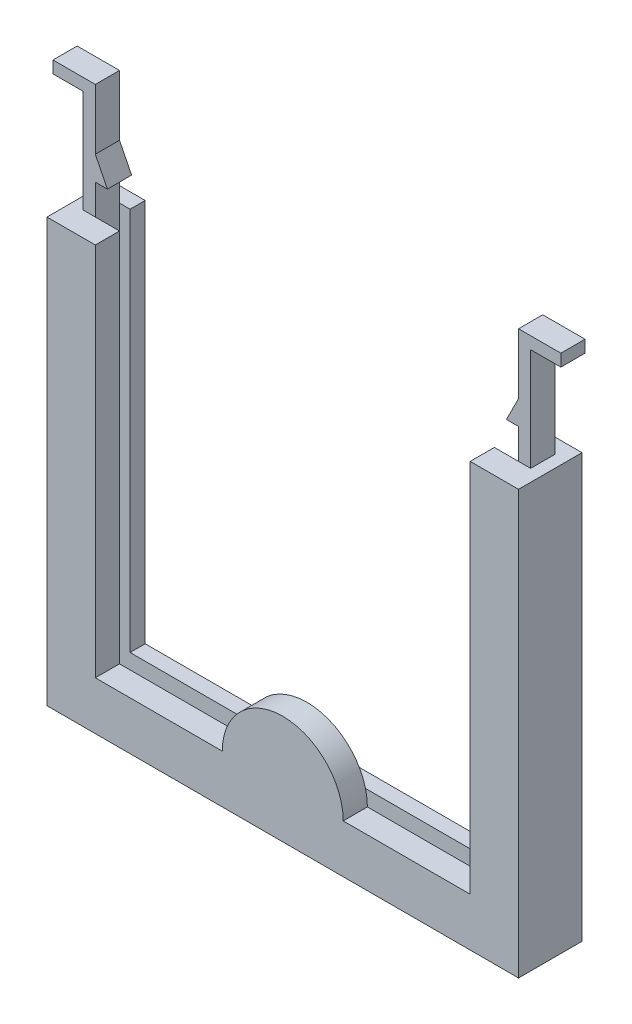
ISO-10303-21;
HEADER;
FILE_DESCRIPTION(('STEP AP214'),'2;1');
FILE_NAME('part.step','',(''),(''),'','','');
FILE_SCHEMA(('AUTOMOTIVE_DESIGN { 1 0 10303 214 1 1 1 1 }'));
ENDSEC;
DATA;
#1=APPLICATION_CONTEXT('core data for automotive mechanical design processes');
#2=APPLICATION_PROTOCOL_DEFINITION('international standard','automotive_design',2000,#1);
#3=PRODUCT_CONTEXT('',#1,'mechanical');
#4=PRODUCT('Part','Part','',(#3));
#5=PRODUCT_RELATED_PRODUCT_CATEGORY('part','',(#4));
#6=PRODUCT_DEFINITION_FORMATION('','',#4);
#7=PRODUCT_DEFINITION_CONTEXT('part definition',#1,'design');
#8=PRODUCT_DEFINITION('design','',#6,#7);
#9=PRODUCT_DEFINITION_SHAPE('','',#8);
#10=(LENGTH_UNIT() NAMED_UNIT(*) SI_UNIT(.MILLI.,.METRE.));
#11=(NAMED_UNIT(*) PLANE_ANGLE_UNIT() SI_UNIT($,.RADIAN.));
#12=(NAMED_UNIT(*) SI_UNIT($,.STERADIAN.) SOLID_ANGLE_UNIT());
#13=UNCERTAINTY_MEASURE_WITH_UNIT(LENGTH_MEASURE(1.E-05),#10,'distance_accuracy_value','');
#14=(GEOMETRIC_REPRESENTATION_CONTEXT(3) GLOBAL_UNCERTAINTY_ASSIGNED_CONTEXT((#13)) GLOBAL_UNIT_ASSIGNED_CONTEXT((#10,
#11,#12)) REPRESENTATION_CONTEXT('',''));
#15=CARTESIAN_POINT('',(0.,0.,0.));
#16=DIRECTION('',(0.,0.,1.));
#17=DIRECTION('',(1.,0.,0.));
#18=AXIS2_PLACEMENT_3D('',#15,#16,#17);
#19=CARTESIAN_POINT('',(-70.,7.99999999999999,10.5));
#20=DIRECTION('',(0.,-1.,0.));
#21=DIRECTION('',(0.,0.,-1.));
#22=AXIS2_PLACEMENT_3D('',#19,#20,#21);
#23=PLANE('',#22);
#24=DIRECTION('',(-1.,0.,0.));
#25=VECTOR('',#24,1.);
#26=CARTESIAN_POINT('',(-70.,7.99999999999999,6.5));
#27=LINE('',#26,#25);
#28=CARTESIAN_POINT('',(-8.,7.99999999999999,6.5));
#29=VERTEX_POINT('',#28);
#30=CARTESIAN_POINT('',(-29.,7.99999999999999,6.5));
#31=VERTEX_POINT('',#30);
#32=EDGE_CURVE('E284',#29,#31,#27,.T.);
#33=ORIENTED_EDGE('',*,*,#32,.T.);
#34=DIRECTION('',(0.,0.,1.));
#35=VECTOR('',#34,1.);
#36=CARTESIAN_POINT('',(-29.,7.99999999999999,6.5));
#37=LINE('',#36,#35);
#38=CARTESIAN_POINT('',(-29.,7.99999999999999,10.5));
#39=VERTEX_POINT('',#38);
#40=EDGE_CURVE('E266',#31,#39,#37,.T.);
#41=ORIENTED_EDGE('',*,*,#40,.T.);
#42=DIRECTION('',(-1.,0.,0.));
#43=VECTOR('',#42,1.);
#44=CARTESIAN_POINT('',(-70.,7.99999999999999,10.5));
#45=LINE('',#44,#43);
#46=CARTESIAN_POINT('',(-8.,7.99999999999999,10.5));
#47=VERTEX_POINT('',#46);
#48=EDGE_CURVE('E535',#47,#39,#45,.T.);
#49=ORIENTED_EDGE('',*,*,#48,.F.);
#50=DIRECTION('',(0.,0.,-1.));
#51=VECTOR('',#50,1.);
#52=CARTESIAN_POINT('',(-8.,7.99999999999999,10.5));
#53=LINE('',#52,#51);
#54=EDGE_CURVE('E510',#47,#29,#53,.T.);
#55=ORIENTED_EDGE('',*,*,#54,.T.);
#56=EDGE_LOOP('',(#33,#41,#49,#55));
#57=FACE_BOUND('',#56,.T.);
#58=ADVANCED_FACE('F37',(#57),#23,.F.);
#59=CARTESIAN_POINT('',(-76.,79.,6.5));
#60=DIRECTION('',(1.,0.,0.));
#61=DIRECTION('',(0.,1.,0.));
#62=AXIS2_PLACEMENT_3D('',#59,#60,#61);
#63=PLANE('',#62);
#64=DIRECTION('',(0.,0.,1.));
#65=VECTOR('',#64,1.);
#66=CARTESIAN_POINT('',(-76.,87.,6.5));
#67=LINE('',#66,#65);
#68=CARTESIAN_POINT('',(-76.,87.,2.5));
#69=VERTEX_POINT('',#68);
#70=CARTESIAN_POINT('',(-76.,87.,6.5));
#71=VERTEX_POINT('',#70);
#72=EDGE_CURVE('E586',#69,#71,#67,.T.);
#73=ORIENTED_EDGE('',*,*,#72,.F.);
#74=DIRECTION('',(0.,-1.,0.));
#75=VECTOR('',#74,1.);
#76=CARTESIAN_POINT('',(-76.,79.,2.5));
#77=LINE('',#76,#75);
#78=CARTESIAN_POINT('',(-76.,70.,2.5));
#79=VERTEX_POINT('',#78);
#80=EDGE_CURVE('E339',#69,#79,#77,.T.);
#81=ORIENTED_EDGE('',*,*,#80,.T.);
#82=DIRECTION('',(0.,0.,1.));
#83=VECTOR('',#82,1.);
#84=CARTESIAN_POINT('',(-76.,70.,6.5));
#85=LINE('',#84,#83);
#86=CARTESIAN_POINT('',(-76.,70.,6.5));
#87=VERTEX_POINT('',#86);
#88=EDGE_CURVE('E306',#79,#87,#85,.T.);
#89=ORIENTED_EDGE('',*,*,#88,.T.);
#90=DIRECTION('',(0.,-1.,0.));
#91=VECTOR('',#90,1.);
#92=CARTESIAN_POINT('',(-76.,79.,6.5));
#93=LINE('',#92,#91);
#94=EDGE_CURVE('E41',#71,#87,#93,.T.);
#95=ORIENTED_EDGE('',*,*,#94,.F.);
#96=EDGE_LOOP('',(#73,#81,#89,#95));
#97=FACE_BOUND('',#96,.T.);
#98=ADVANCED_FACE('F621',(#97),#63,.F.);
#99=CARTESIAN_POINT('',(-2.,79.,6.5));
#100=DIRECTION('',(-1.,0.,0.));
#101=DIRECTION('',(0.,-1.,0.));
#102=AXIS2_PLACEMENT_3D('',#99,#100,#101);
#103=PLANE('',#102);
#104=DIRECTION('',(0.,0.,-1.));
#105=VECTOR('',#104,1.);
#106=CARTESIAN_POINT('',(-2.00000000000001,87.,6.5));
#107=LINE('',#106,#105);
#108=CARTESIAN_POINT('',(-2.00000000000001,87.,6.5));
#109=VERTEX_POINT('',#108);
#110=CARTESIAN_POINT('',(-2.00000000000001,87.,2.5));
#111=VERTEX_POINT('',#110);
#112=EDGE_CURVE('E568',#109,#111,#107,.T.);
#113=ORIENTED_EDGE('',*,*,#112,.F.);
#114=DIRECTION('',(0.,-1.,0.));
#115=VECTOR('',#114,1.);
#116=CARTESIAN_POINT('',(-2.,79.,6.5));
#117=LINE('',#116,#115);
#118=CARTESIAN_POINT('',(-2.,70.,6.5));
#119=VERTEX_POINT('',#118);
#120=EDGE_CURVE('E317',#109,#119,#117,.T.);
#121=ORIENTED_EDGE('',*,*,#120,.T.);
#122=DIRECTION('',(0.,0.,-1.));
#123=VECTOR('',#122,1.);
#124=CARTESIAN_POINT('',(-2.,70.,6.5));
#125=LINE('',#124,#123);
#126=CARTESIAN_POINT('',(-2.,70.,2.5));
#127=VERTEX_POINT('',#126);
#128=EDGE_CURVE('E315',#119,#127,#125,.T.);
#129=ORIENTED_EDGE('',*,*,#128,.T.);
#130=DIRECTION('',(0.,-1.,0.));
#131=VECTOR('',#130,1.);
#132=CARTESIAN_POINT('',(-2.,79.,2.5));
#133=LINE('',#132,#131);
#134=EDGE_CURVE('E318',#111,#127,#133,.T.);
#135=ORIENTED_EDGE('',*,*,#134,.F.);
#136=EDGE_LOOP('',(#113,#121,#129,#135));
#137=FACE_BOUND('',#136,.T.);
#138=ADVANCED_FACE('F626',(#137),#103,.F.);
#139=CARTESIAN_POINT('',(0.,0.,6.5));
#140=DIRECTION('',(0.,0.,1.));
#141=DIRECTION('',(1.,0.,0.));
#142=AXIS2_PLACEMENT_3D('',#139,#140,#141);
#143=PLANE('',#142);
#144=DIRECTION('',(-1.,0.,0.));
#145=VECTOR('',#144,1.);
#146=CARTESIAN_POINT('',(-8.,70.,6.5));
#147=LINE('',#146,#145);
#148=CARTESIAN_POINT('',(-4.,70.,6.5));
#149=VERTEX_POINT('',#148);
#150=EDGE_CURVE('E11',#119,#149,#147,.T.);
#151=ORIENTED_EDGE('',*,*,#150,.F.);
#152=ORIENTED_EDGE('',*,*,#120,.F.);
#153=DIRECTION('',(-1.,0.,0.));
#154=VECTOR('',#153,1.);
#155=CARTESIAN_POINT('',(2.99999999999999,87.,6.5));
#156=LINE('',#155,#154);
#157=CARTESIAN_POINT('',(2.99999999999999,87.,6.5));
#158=VERTEX_POINT('',#157);
#159=EDGE_CURVE('E563',#158,#109,#156,.T.);
#160=ORIENTED_EDGE('',*,*,#159,.F.);
#161=DIRECTION('',(0.,-1.,0.));
#162=VECTOR('',#161,1.);
#163=CARTESIAN_POINT('',(2.99999999999999,89.,6.5));
#164=LINE('',#163,#162);
#165=CARTESIAN_POINT('',(2.99999999999999,89.,6.5));
#166=VERTEX_POINT('',#165);
#167=EDGE_CURVE('E570',#166,#158,#164,.T.);
#168=ORIENTED_EDGE('',*,*,#167,.F.);
#169=DIRECTION('',(1.,0.,0.));
#170=VECTOR('',#169,1.);
#171=CARTESIAN_POINT('',(-2.,89.,6.5));
#172=LINE('',#171,#170);
#173=CARTESIAN_POINT('',(-4.,89.,6.5));
#174=VERTEX_POINT('',#173);
#175=EDGE_CURVE('E544',#174,#166,#172,.T.);
#176=ORIENTED_EDGE('',*,*,#175,.F.);
#177=DIRECTION('',(0.,-1.,0.));
#178=VECTOR('',#177,1.);
#179=CARTESIAN_POINT('',(-4.,89.,6.5));
#180=LINE('',#179,#178);
#181=CARTESIAN_POINT('',(-4.,79.,6.5));
#182=VERTEX_POINT('',#181);
#183=EDGE_CURVE('E542',#174,#182,#180,.T.);
#184=ORIENTED_EDGE('',*,*,#183,.T.);
#185=DIRECTION('',(-0.447213595499958,-0.894427190999916,0.));
#186=VECTOR('',#185,1.);
#187=CARTESIAN_POINT('',(-4.,79.,6.5));
#188=LINE('',#187,#186);
#189=CARTESIAN_POINT('',(-6.,75.,6.5));
#190=VERTEX_POINT('',#189);
#191=EDGE_CURVE('E491',#182,#190,#188,.T.);
#192=ORIENTED_EDGE('',*,*,#191,.T.);
#193=DIRECTION('',(1.,0.,0.));
#194=VECTOR('',#193,1.);
#195=CARTESIAN_POINT('',(-6.,75.,6.5));
#196=LINE('',#195,#194);
#197=CARTESIAN_POINT('',(-4.,75.,6.5));
#198=VERTEX_POINT('',#197);
#199=EDGE_CURVE('E469',#190,#198,#196,.T.);
#200=ORIENTED_EDGE('',*,*,#199,.T.);
#201=DIRECTION('',(0.,1.,0.));
#202=VECTOR('',#201,1.);
#203=CARTESIAN_POINT('',(-4.,0.,6.5));
#204=LINE('',#203,#202);
#205=EDGE_CURVE('E388',#149,#198,#204,.T.);
#206=ORIENTED_EDGE('',*,*,#205,.F.);
#207=EDGE_LOOP('',(#151,#152,#160,#168,#176,#184,#192,#200,#206));
#208=FACE_BOUND('',#207,.T.);
#209=ADVANCED_FACE('F464',(#208),#143,.T.);
#210=CARTESIAN_POINT('',(0.,70.,6.5));
#211=DIRECTION('',(0.,-1.,0.));
#212=DIRECTION('',(1.,0.,0.));
#213=AXIS2_PLACEMENT_3D('',#210,#211,#212);
#214=PLANE('',#213);
#215=ORIENTED_EDGE('',*,*,#128,.F.);
#216=ORIENTED_EDGE('',*,*,#150,.T.);
#217=CARTESIAN_POINT('',(-8.,70.,6.5));
#218=VERTEX_POINT('',#217);
#219=EDGE_CURVE('E287',#149,#218,#147,.T.);
#220=ORIENTED_EDGE('',*,*,#219,.T.);
#221=DIRECTION('',(0.,0.,-1.));
#222=VECTOR('',#221,1.);
#223=CARTESIAN_POINT('',(-8.,70.,10.5));
#224=LINE('',#223,#222);
#225=CARTESIAN_POINT('',(-8.,70.,10.5));
#226=VERTEX_POINT('',#225);
#227=EDGE_CURVE('E506',#226,#218,#224,.T.);
#228=ORIENTED_EDGE('',*,*,#227,.F.);
#229=DIRECTION('',(-1.,0.,0.));
#230=VECTOR('',#229,1.);
#231=CARTESIAN_POINT('',(-8.,70.,10.5));
#232=LINE('',#231,#230);
#233=CARTESIAN_POINT('',(0.,70.,10.5));
#234=VERTEX_POINT('',#233);
#235=EDGE_CURVE('E296',#234,#226,#232,.T.);
#236=ORIENTED_EDGE('',*,*,#235,.F.);
#237=DIRECTION('',(0.,0.,-1.));
#238=VECTOR('',#237,1.);
#239=CARTESIAN_POINT('',(0.,70.,6.5));
#240=LINE('',#239,#238);
#241=CARTESIAN_POINT('',(0.,70.,0.));
#242=VERTEX_POINT('',#241);
#243=EDGE_CURVE('E394',#234,#242,#240,.T.);
#244=ORIENTED_EDGE('',*,*,#243,.T.);
#245=DIRECTION('',(-1.,0.,0.));
#246=VECTOR('',#245,1.);
#247=CARTESIAN_POINT('',(0.,70.,0.));
#248=LINE('',#247,#246);
#249=CARTESIAN_POINT('',(-5.75,70.,0.));
#250=VERTEX_POINT('',#249);
#251=EDGE_CURVE('E398',#242,#250,#248,.T.);
#252=ORIENTED_EDGE('',*,*,#251,.T.);
#253=DIRECTION('',(0.,0.,-1.));
#254=VECTOR('',#253,1.);
#255=CARTESIAN_POINT('',(-5.75,70.,2.5));
#256=LINE('',#255,#254);
#257=CARTESIAN_POINT('',(-5.75,70.,2.5));
#258=VERTEX_POINT('',#257);
#259=EDGE_CURVE('E367',#258,#250,#256,.T.);
#260=ORIENTED_EDGE('',*,*,#259,.F.);
#261=DIRECTION('',(1.,0.,0.));
#262=VECTOR('',#261,1.);
#263=CARTESIAN_POINT('',(0.,70.,2.5));
#264=LINE('',#263,#262);
#265=CARTESIAN_POINT('',(-4.,70.,2.5));
#266=VERTEX_POINT('',#265);
#267=EDGE_CURVE('E356',#258,#266,#264,.T.);
#268=ORIENTED_EDGE('',*,*,#267,.T.);
#269=DIRECTION('',(-1.,0.,0.));
#270=VECTOR('',#269,1.);
#271=CARTESIAN_POINT('',(-4.,70.,2.5));
#272=LINE('',#271,#270);
#273=EDGE_CURVE('E435',#127,#266,#272,.T.);
#274=ORIENTED_EDGE('',*,*,#273,.F.);
#275=EDGE_LOOP('',(#215,#216,#220,#228,#236,#244,#252,#260,#268,#274));
#276=FACE_BOUND('',#275,.T.);
#277=ADVANCED_FACE('F434',(#276),#214,.F.);
#278=CARTESIAN_POINT('',(-72.25,70.,0.));
#279=VERTEX_POINT('',#278);
#280=CARTESIAN_POINT('',(-78.,70.,0.));
#281=VERTEX_POINT('',#280);
#282=EDGE_CURVE('E383',#279,#281,#248,.T.);
#283=ORIENTED_EDGE('',*,*,#282,.T.);
#284=DIRECTION('',(0.,0.,-1.));
#285=VECTOR('',#284,1.);
#286=CARTESIAN_POINT('',(-78.,70.,6.5));
#287=LINE('',#286,#285);
#288=CARTESIAN_POINT('',(-78.,70.,10.5));
#289=VERTEX_POINT('',#288);
#290=EDGE_CURVE('E412',#289,#281,#287,.T.);
#291=ORIENTED_EDGE('',*,*,#290,.F.);
#292=DIRECTION('',(-1.,0.,0.));
#293=VECTOR('',#292,1.);
#294=CARTESIAN_POINT('',(-78.,70.,10.5));
#295=LINE('',#294,#293);
#296=CARTESIAN_POINT('',(-70.,70.,10.5));
#297=VERTEX_POINT('',#296);
#298=EDGE_CURVE('E530',#297,#289,#295,.T.);
#299=ORIENTED_EDGE('',*,*,#298,.F.);
#300=DIRECTION('',(0.,0.,-1.));
#301=VECTOR('',#300,1.);
#302=CARTESIAN_POINT('',(-70.,70.,10.5));
#303=LINE('',#302,#301);
#304=CARTESIAN_POINT('',(-70.,70.,6.5));
#305=VERTEX_POINT('',#304);
#306=EDGE_CURVE('E297',#297,#305,#303,.T.);
#307=ORIENTED_EDGE('',*,*,#306,.T.);
#308=DIRECTION('',(-1.,0.,0.));
#309=VECTOR('',#308,1.);
#310=CARTESIAN_POINT('',(-78.,70.,6.5));
#311=LINE('',#310,#309);
#312=CARTESIAN_POINT('',(-74.,70.,6.5));
#313=VERTEX_POINT('',#312);
#314=EDGE_CURVE('E292',#305,#313,#311,.T.);
#315=ORIENTED_EDGE('',*,*,#314,.T.);
#316=EDGE_CURVE('E47',#313,#87,#311,.T.);
#317=ORIENTED_EDGE('',*,*,#316,.T.);
#318=ORIENTED_EDGE('',*,*,#88,.F.);
#319=DIRECTION('',(-1.,0.,0.));
#320=VECTOR('',#319,1.);
#321=CARTESIAN_POINT('',(-74.,70.,2.5));
#322=LINE('',#321,#320);
#323=CARTESIAN_POINT('',(-74.,70.,2.5));
#324=VERTEX_POINT('',#323);
#325=EDGE_CURVE('E310',#324,#79,#322,.T.);
#326=ORIENTED_EDGE('',*,*,#325,.F.);
#327=DIRECTION('',(1.,0.,0.));
#328=VECTOR('',#327,1.);
#329=CARTESIAN_POINT('',(-72.25,70.,2.5));
#330=LINE('',#329,#328);
#331=CARTESIAN_POINT('',(-72.25,70.,2.5));
#332=VERTEX_POINT('',#331);
#333=EDGE_CURVE('E344',#324,#332,#330,.T.);
#334=ORIENTED_EDGE('',*,*,#333,.T.);
#335=DIRECTION('',(0.,0.,-1.));
#336=VECTOR('',#335,1.);
#337=CARTESIAN_POINT('',(-72.25,70.,2.5));
#338=LINE('',#337,#336);
#339=EDGE_CURVE('E359',#332,#279,#338,.T.);
#340=ORIENTED_EDGE('',*,*,#339,.T.);
#341=EDGE_LOOP('',(#283,#291,#299,#307,#315,#317,#318,#326,#334,#340));
#342=FACE_BOUND('',#341,.T.);
#343=ADVANCED_FACE('F611',(#342),#214,.F.);
#344=CARTESIAN_POINT('',(-4.,0.,6.5));
#345=DIRECTION('',(-1.,0.,0.));
#346=DIRECTION('',(0.,-1.,0.));
#347=AXIS2_PLACEMENT_3D('',#344,#345,#346);
#348=PLANE('',#347);
#349=DIRECTION('',(0.,0.,1.));
#350=VECTOR('',#349,1.);
#351=CARTESIAN_POINT('',(-4.,75.,2.5));
#352=LINE('',#351,#350);
#353=CARTESIAN_POINT('',(-4.,75.,2.5));
#354=VERTEX_POINT('',#353);
#355=EDGE_CURVE('E471',#354,#198,#352,.T.);
#356=ORIENTED_EDGE('',*,*,#355,.F.);
#357=DIRECTION('',(0.,-1.,0.));
#358=VECTOR('',#357,1.);
#359=CARTESIAN_POINT('',(-4.,79.,2.5));
#360=LINE('',#359,#358);
#361=EDGE_CURVE('E327',#354,#266,#360,.T.);
#362=ORIENTED_EDGE('',*,*,#361,.T.);
#363=DIRECTION('',(0.,1.,0.));
#364=VECTOR('',#363,1.);
#365=CARTESIAN_POINT('',(-4.,0.,2.5));
#366=LINE('',#365,#364);
#367=CARTESIAN_POINT('',(-4.,3.99999999999999,2.5));
#368=VERTEX_POINT('',#367);
#369=EDGE_CURVE('E380',#368,#266,#366,.T.);
#370=ORIENTED_EDGE('',*,*,#369,.F.);
#371=DIRECTION('',(0.,0.,-1.));
#372=VECTOR('',#371,1.);
#373=CARTESIAN_POINT('',(-4.,3.99999999999999,6.5));
#374=LINE('',#373,#372);
#375=CARTESIAN_POINT('',(-4.,3.99999999999999,6.5));
#376=VERTEX_POINT('',#375);
#377=EDGE_CURVE('E301',#376,#368,#374,.T.);
#378=ORIENTED_EDGE('',*,*,#377,.F.);
#379=EDGE_CURVE('E384',#376,#149,#204,.T.);
#380=ORIENTED_EDGE('',*,*,#379,.T.);
#381=ORIENTED_EDGE('',*,*,#205,.T.);
#382=EDGE_LOOP('',(#356,#362,#370,#378,#380,#381));
#383=FACE_BOUND('',#382,.T.);
#384=ADVANCED_FACE('F39',(#383),#348,.T.);
#385=CARTESIAN_POINT('',(0.,3.99999999999999,6.5));
#386=DIRECTION('',(0.,1.,0.));
#387=DIRECTION('',(0.,0.,1.));
#388=AXIS2_PLACEMENT_3D('',#385,#386,#387);
#389=PLANE('',#388);
#390=DIRECTION('',(1.,0.,0.));
#391=VECTOR('',#390,1.);
#392=CARTESIAN_POINT('',(0.,3.99999999999999,2.5));
#393=LINE('',#392,#391);
#394=CARTESIAN_POINT('',(-74.,3.99999999999999,2.5));
#395=VERTEX_POINT('',#394);
#396=EDGE_CURVE('E378',#395,#368,#393,.T.);
#397=ORIENTED_EDGE('',*,*,#396,.F.);
#398=DIRECTION('',(0.,0.,-1.));
#399=VECTOR('',#398,1.);
#400=CARTESIAN_POINT('',(-74.,3.99999999999999,6.5));
#401=LINE('',#400,#399);
#402=CARTESIAN_POINT('',(-74.,3.99999999999999,6.5));
#403=VERTEX_POINT('',#402);
#404=EDGE_CURVE('E414',#403,#395,#401,.T.);
#405=ORIENTED_EDGE('',*,*,#404,.F.);
#406=DIRECTION('',(1.,0.,0.));
#407=VECTOR('',#406,1.);
#408=CARTESIAN_POINT('',(0.,3.99999999999999,6.5));
#409=LINE('',#408,#407);
#410=EDGE_CURVE('E387',#403,#376,#409,.T.);
#411=ORIENTED_EDGE('',*,*,#410,.T.);
#412=ORIENTED_EDGE('',*,*,#377,.T.);
#413=EDGE_LOOP('',(#397,#405,#411,#412));
#414=FACE_BOUND('',#413,.T.);
#415=ADVANCED_FACE('F419',(#414),#389,.T.);
#416=CARTESIAN_POINT('',(-74.,0.,6.5));
#417=DIRECTION('',(1.,0.,0.));
#418=DIRECTION('',(0.,1.,0.));
#419=AXIS2_PLACEMENT_3D('',#416,#417,#418);
#420=PLANE('',#419);
#421=DIRECTION('',(0.,0.,1.));
#422=VECTOR('',#421,1.);
#423=CARTESIAN_POINT('',(-74.,75.,2.5));
#424=LINE('',#423,#422);
#425=CARTESIAN_POINT('',(-74.,75.,2.5));
#426=VERTEX_POINT('',#425);
#427=CARTESIAN_POINT('',(-74.,75.,6.5));
#428=VERTEX_POINT('',#427);
#429=EDGE_CURVE('E494',#426,#428,#424,.T.);
#430=ORIENTED_EDGE('',*,*,#429,.T.);
#431=DIRECTION('',(0.,-1.,0.));
#432=VECTOR('',#431,1.);
#433=CARTESIAN_POINT('',(-74.,0.,6.5));
#434=LINE('',#433,#432);
#435=EDGE_CURVE('E392',#428,#313,#434,.T.);
#436=ORIENTED_EDGE('',*,*,#435,.T.);
#437=EDGE_CURVE('E391',#313,#403,#434,.T.);
#438=ORIENTED_EDGE('',*,*,#437,.T.);
#439=ORIENTED_EDGE('',*,*,#404,.T.);
#440=DIRECTION('',(0.,-1.,0.));
#441=VECTOR('',#440,1.);
#442=CARTESIAN_POINT('',(-74.,0.,2.5));
#443=LINE('',#442,#441);
#444=EDGE_CURVE('E370',#324,#395,#443,.T.);
#445=ORIENTED_EDGE('',*,*,#444,.F.);
#446=DIRECTION('',(0.,-1.,0.));
#447=VECTOR('',#446,1.);
#448=CARTESIAN_POINT('',(-74.,79.,2.5));
#449=LINE('',#448,#447);
#450=EDGE_CURVE('E341',#426,#324,#449,.T.);
#451=ORIENTED_EDGE('',*,*,#450,.F.);
#452=EDGE_LOOP('',(#430,#436,#438,#439,#445,#451));
#453=FACE_BOUND('',#452,.T.);
#454=ADVANCED_FACE('F456',(#453),#420,.T.);
#455=CARTESIAN_POINT('',(-78.,0.,6.5));
#456=DIRECTION('',(-1.,0.,0.));
#457=DIRECTION('',(0.,0.,1.));
#458=AXIS2_PLACEMENT_3D('',#455,#456,#457);
#459=PLANE('',#458);
#460=DIRECTION('',(0.,1.,0.));
#461=VECTOR('',#460,1.);
#462=CARTESIAN_POINT('',(-78.,0.,0.));
#463=LINE('',#462,#461);
#464=CARTESIAN_POINT('',(-78.,0.,0.));
#465=VERTEX_POINT('',#464);
#466=EDGE_CURVE('E397',#465,#281,#463,.T.);
#467=ORIENTED_EDGE('',*,*,#466,.F.);
#468=DIRECTION('',(0.,0.,-1.));
#469=VECTOR('',#468,1.);
#470=CARTESIAN_POINT('',(-78.,0.,6.5));
#471=LINE('',#470,#469);
#472=CARTESIAN_POINT('',(-78.,0.,10.5));
#473=VERTEX_POINT('',#472);
#474=EDGE_CURVE('E410',#473,#465,#471,.T.);
#475=ORIENTED_EDGE('',*,*,#474,.F.);
#476=DIRECTION('',(0.,-1.,0.));
#477=VECTOR('',#476,1.);
#478=CARTESIAN_POINT('',(-78.,0.,10.5));
#479=LINE('',#478,#477);
#480=EDGE_CURVE('E525',#289,#473,#479,.T.);
#481=ORIENTED_EDGE('',*,*,#480,.F.);
#482=ORIENTED_EDGE('',*,*,#290,.T.);
#483=EDGE_LOOP('',(#467,#475,#481,#482));
#484=FACE_BOUND('',#483,.T.);
#485=ADVANCED_FACE('F880',(#484),#459,.T.);
#486=CARTESIAN_POINT('',(0.,0.,6.5));
#487=DIRECTION('',(0.,-1.,0.));
#488=DIRECTION('',(1.,0.,0.));
#489=AXIS2_PLACEMENT_3D('',#486,#487,#488);
#490=PLANE('',#489);
#491=DIRECTION('',(-1.,0.,0.));
#492=VECTOR('',#491,1.);
#493=CARTESIAN_POINT('',(0.,0.,0.));
#494=LINE('',#493,#492);
#495=CARTESIAN_POINT('',(0.,0.,0.));
#496=VERTEX_POINT('',#495);
#497=EDGE_CURVE('E401',#496,#465,#494,.T.);
#498=ORIENTED_EDGE('',*,*,#497,.F.);
#499=DIRECTION('',(0.,0.,-1.));
#500=VECTOR('',#499,1.);
#501=CARTESIAN_POINT('',(0.,0.,6.5));
#502=LINE('',#501,#500);
#503=CARTESIAN_POINT('',(0.,0.,10.5));
#504=VERTEX_POINT('',#503);
#505=EDGE_CURVE('E408',#504,#496,#502,.T.);
#506=ORIENTED_EDGE('',*,*,#505,.F.);
#507=DIRECTION('',(1.,0.,0.));
#508=VECTOR('',#507,1.);
#509=CARTESIAN_POINT('',(0.,0.,10.5));
#510=LINE('',#509,#508);
#511=EDGE_CURVE('E520',#473,#504,#510,.T.);
#512=ORIENTED_EDGE('',*,*,#511,.F.);
#513=ORIENTED_EDGE('',*,*,#474,.T.);
#514=EDGE_LOOP('',(#498,#506,#512,#513));
#515=FACE_BOUND('',#514,.T.);
#516=ADVANCED_FACE('F883',(#515),#490,.T.);
#517=CARTESIAN_POINT('',(0.,0.,6.5));
#518=DIRECTION('',(-1.,0.,0.));
#519=DIRECTION('',(0.,-1.,0.));
#520=AXIS2_PLACEMENT_3D('',#517,#518,#519);
#521=PLANE('',#520);
#522=DIRECTION('',(0.,1.,0.));
#523=VECTOR('',#522,1.);
#524=CARTESIAN_POINT('',(0.,0.,0.));
#525=LINE('',#524,#523);
#526=EDGE_CURVE('E404',#496,#242,#525,.T.);
#527=ORIENTED_EDGE('',*,*,#526,.T.);
#528=ORIENTED_EDGE('',*,*,#243,.F.);
#529=DIRECTION('',(0.,1.,0.));
#530=VECTOR('',#529,1.);
#531=CARTESIAN_POINT('',(0.,70.,10.5));
#532=LINE('',#531,#530);
#533=EDGE_CURVE('E516',#504,#234,#532,.T.);
#534=ORIENTED_EDGE('',*,*,#533,.F.);
#535=ORIENTED_EDGE('',*,*,#505,.T.);
#536=EDGE_LOOP('',(#527,#528,#534,#535));
#537=FACE_BOUND('',#536,.T.);
#538=ADVANCED_FACE('F606',(#537),#521,.F.);
#539=ORIENTED_EDGE('',*,*,#316,.F.);
#540=ORIENTED_EDGE('',*,*,#435,.F.);
#541=DIRECTION('',(1.,0.,0.));
#542=VECTOR('',#541,1.);
#543=CARTESIAN_POINT('',(-72.,75.,6.5));
#544=LINE('',#543,#542);
#545=CARTESIAN_POINT('',(-72.,75.,6.5));
#546=VERTEX_POINT('',#545);
#547=EDGE_CURVE('E504',#428,#546,#544,.T.);
#548=ORIENTED_EDGE('',*,*,#547,.T.);
#549=DIRECTION('',(-0.447213595499958,0.894427190999916,0.));
#550=VECTOR('',#549,1.);
#551=CARTESIAN_POINT('',(-74.,79.,6.5));
#552=LINE('',#551,#550);
#553=CARTESIAN_POINT('',(-74.,79.,6.5));
#554=VERTEX_POINT('',#553);
#555=EDGE_CURVE('E501',#546,#554,#552,.T.);
#556=ORIENTED_EDGE('',*,*,#555,.T.);
#557=DIRECTION('',(0.,-1.,0.));
#558=VECTOR('',#557,1.);
#559=CARTESIAN_POINT('',(-74.,89.,6.5));
#560=LINE('',#559,#558);
#561=CARTESIAN_POINT('',(-74.,89.,6.5));
#562=VERTEX_POINT('',#561);
#563=EDGE_CURVE('E553',#562,#554,#560,.T.);
#564=ORIENTED_EDGE('',*,*,#563,.F.);
#565=DIRECTION('',(1.,0.,0.));
#566=VECTOR('',#565,1.);
#567=CARTESIAN_POINT('',(-74.,89.,6.5));
#568=LINE('',#567,#566);
#569=CARTESIAN_POINT('',(-81.,89.,6.5));
#570=VERTEX_POINT('',#569);
#571=EDGE_CURVE('E556',#570,#562,#568,.T.);
#572=ORIENTED_EDGE('',*,*,#571,.F.);
#573=DIRECTION('',(0.,1.,0.));
#574=VECTOR('',#573,1.);
#575=CARTESIAN_POINT('',(-81.,89.,6.5));
#576=LINE('',#575,#574);
#577=CARTESIAN_POINT('',(-81.,87.,6.5));
#578=VERTEX_POINT('',#577);
#579=EDGE_CURVE('E588',#578,#570,#576,.T.);
#580=ORIENTED_EDGE('',*,*,#579,.F.);
#581=DIRECTION('',(1.,0.,0.));
#582=VECTOR('',#581,1.);
#583=CARTESIAN_POINT('',(-81.,87.,6.5));
#584=LINE('',#583,#582);
#585=EDGE_CURVE('E582',#578,#71,#584,.T.);
#586=ORIENTED_EDGE('',*,*,#585,.T.);
#587=ORIENTED_EDGE('',*,*,#94,.T.);
#588=EDGE_LOOP('',(#539,#540,#548,#556,#564,#572,#580,#586,#587));
#589=FACE_BOUND('',#588,.T.);
#590=ADVANCED_FACE('F671',(#589),#143,.T.);
#591=CARTESIAN_POINT('',(0.,0.,0.));
#592=DIRECTION('',(0.,0.,1.));
#593=DIRECTION('',(1.,0.,0.));
#594=AXIS2_PLACEMENT_3D('',#591,#592,#593);
#595=PLANE('',#594);
#596=DIRECTION('',(0.,1.,0.));
#597=VECTOR('',#596,1.);
#598=CARTESIAN_POINT('',(-5.75,70.,0.));
#599=LINE('',#598,#597);
#600=CARTESIAN_POINT('',(-5.75000000000001,6.49999999999999,0.));
#601=VERTEX_POINT('',#600);
#602=EDGE_CURVE('E347',#601,#250,#599,.T.);
#603=ORIENTED_EDGE('',*,*,#602,.T.);
#604=ORIENTED_EDGE('',*,*,#251,.F.);
#605=ORIENTED_EDGE('',*,*,#526,.F.);
#606=ORIENTED_EDGE('',*,*,#497,.T.);
#607=ORIENTED_EDGE('',*,*,#466,.T.);
#608=ORIENTED_EDGE('',*,*,#282,.F.);
#609=DIRECTION('',(0.,-1.,0.));
#610=VECTOR('',#609,1.);
#611=CARTESIAN_POINT('',(-72.25,6.49999999999999,0.));
#612=LINE('',#611,#610);
#613=CARTESIAN_POINT('',(-72.25,6.49999999999999,0.));
#614=VERTEX_POINT('',#613);
#615=EDGE_CURVE('E343',#279,#614,#612,.T.);
#616=ORIENTED_EDGE('',*,*,#615,.T.);
#617=DIRECTION('',(1.,0.,0.));
#618=VECTOR('',#617,1.);
#619=CARTESIAN_POINT('',(-5.75000000000001,6.49999999999999,0.));
#620=LINE('',#619,#618);
#621=EDGE_CURVE('E362',#614,#601,#620,.T.);
#622=ORIENTED_EDGE('',*,*,#621,.T.);
#623=EDGE_LOOP('',(#603,#604,#605,#606,#607,#608,#616,#622));
#624=FACE_BOUND('',#623,.T.);
#625=ADVANCED_FACE('F609',(#624),#595,.F.);
#626=CARTESIAN_POINT('',(-5.75,70.,2.5));
#627=DIRECTION('',(-1.,0.,0.));
#628=DIRECTION('',(0.,-1.,0.));
#629=AXIS2_PLACEMENT_3D('',#626,#627,#628);
#630=PLANE('',#629);
#631=ORIENTED_EDGE('',*,*,#602,.F.);
#632=DIRECTION('',(0.,0.,-1.));
#633=VECTOR('',#632,1.);
#634=CARTESIAN_POINT('',(-5.75000000000001,6.49999999999999,2.5));
#635=LINE('',#634,#633);
#636=CARTESIAN_POINT('',(-5.75000000000001,6.49999999999999,2.5));
#637=VERTEX_POINT('',#636);
#638=EDGE_CURVE('E371',#637,#601,#635,.T.);
#639=ORIENTED_EDGE('',*,*,#638,.F.);
#640=DIRECTION('',(0.,1.,0.));
#641=VECTOR('',#640,1.);
#642=CARTESIAN_POINT('',(-5.75,70.,2.5));
#643=LINE('',#642,#641);
#644=EDGE_CURVE('E353',#637,#258,#643,.T.);
#645=ORIENTED_EDGE('',*,*,#644,.T.);
#646=ORIENTED_EDGE('',*,*,#259,.T.);
#647=EDGE_LOOP('',(#631,#639,#645,#646));
#648=FACE_BOUND('',#647,.T.);
#649=ADVANCED_FACE('F439',(#648),#630,.T.);
#650=CARTESIAN_POINT('',(-5.75000000000001,6.49999999999999,2.5));
#651=DIRECTION('',(0.,1.,0.));
#652=DIRECTION('',(-1.,0.,0.));
#653=AXIS2_PLACEMENT_3D('',#650,#651,#652);
#654=PLANE('',#653);
#655=ORIENTED_EDGE('',*,*,#621,.F.);
#656=DIRECTION('',(0.,0.,-1.));
#657=VECTOR('',#656,1.);
#658=CARTESIAN_POINT('',(-72.25,6.49999999999999,2.5));
#659=LINE('',#658,#657);
#660=CARTESIAN_POINT('',(-72.25,6.49999999999999,2.5));
#661=VERTEX_POINT('',#660);
#662=EDGE_CURVE('E373',#661,#614,#659,.T.);
#663=ORIENTED_EDGE('',*,*,#662,.F.);
#664=DIRECTION('',(1.,0.,0.));
#665=VECTOR('',#664,1.);
#666=CARTESIAN_POINT('',(-5.75000000000001,6.49999999999999,2.5));
#667=LINE('',#666,#665);
#668=EDGE_CURVE('E350',#661,#637,#667,.T.);
#669=ORIENTED_EDGE('',*,*,#668,.T.);
#670=ORIENTED_EDGE('',*,*,#638,.T.);
#671=EDGE_LOOP('',(#655,#663,#669,#670));
#672=FACE_BOUND('',#671,.T.);
#673=ADVANCED_FACE('F444',(#672),#654,.T.);
#674=CARTESIAN_POINT('',(-72.25,6.49999999999999,2.5));
#675=DIRECTION('',(1.,0.,0.));
#676=DIRECTION('',(0.,0.,-1.));
#677=AXIS2_PLACEMENT_3D('',#674,#675,#676);
#678=PLANE('',#677);
#679=ORIENTED_EDGE('',*,*,#615,.F.);
#680=ORIENTED_EDGE('',*,*,#339,.F.);
#681=DIRECTION('',(0.,-1.,0.));
#682=VECTOR('',#681,1.);
#683=CARTESIAN_POINT('',(-72.25,6.49999999999999,2.5));
#684=LINE('',#683,#682);
#685=EDGE_CURVE('E346',#332,#661,#684,.T.);
#686=ORIENTED_EDGE('',*,*,#685,.T.);
#687=ORIENTED_EDGE('',*,*,#662,.T.);
#688=EDGE_LOOP('',(#679,#680,#686,#687));
#689=FACE_BOUND('',#688,.T.);
#690=ADVANCED_FACE('F447',(#689),#678,.T.);
#691=CARTESIAN_POINT('',(0.,0.,2.5));
#692=DIRECTION('',(0.,0.,1.));
#693=DIRECTION('',(1.,0.,0.));
#694=AXIS2_PLACEMENT_3D('',#691,#692,#693);
#695=PLANE('',#694);
#696=ORIENTED_EDGE('',*,*,#396,.T.);
#697=ORIENTED_EDGE('',*,*,#369,.T.);
#698=ORIENTED_EDGE('',*,*,#267,.F.);
#699=ORIENTED_EDGE('',*,*,#644,.F.);
#700=ORIENTED_EDGE('',*,*,#668,.F.);
#701=ORIENTED_EDGE('',*,*,#685,.F.);
#702=ORIENTED_EDGE('',*,*,#333,.F.);
#703=ORIENTED_EDGE('',*,*,#444,.T.);
#704=EDGE_LOOP('',(#696,#697,#698,#699,#700,#701,#702,#703));
#705=FACE_BOUND('',#704,.T.);
#706=ADVANCED_FACE('F429',(#705),#695,.T.);
#707=CARTESIAN_POINT('',(-74.,79.,2.5));
#708=DIRECTION('',(0.,0.,1.));
#709=DIRECTION('',(1.,0.,0.));
#710=AXIS2_PLACEMENT_3D('',#707,#708,#709);
#711=PLANE('',#710);
#712=ORIENTED_EDGE('',*,*,#325,.T.);
#713=ORIENTED_EDGE('',*,*,#80,.F.);
#714=DIRECTION('',(1.,0.,0.));
#715=VECTOR('',#714,1.);
#716=CARTESIAN_POINT('',(-81.,87.,2.5));
#717=LINE('',#716,#715);
#718=CARTESIAN_POINT('',(-81.,87.,2.5));
#719=VERTEX_POINT('',#718);
#720=EDGE_CURVE('E571',#719,#69,#717,.T.);
#721=ORIENTED_EDGE('',*,*,#720,.F.);
#722=DIRECTION('',(0.,-1.,0.));
#723=VECTOR('',#722,1.);
#724=CARTESIAN_POINT('',(-81.,89.,2.5));
#725=LINE('',#724,#723);
#726=CARTESIAN_POINT('',(-81.,89.,2.5));
#727=VERTEX_POINT('',#726);
#728=EDGE_CURVE('E590',#727,#719,#725,.T.);
#729=ORIENTED_EDGE('',*,*,#728,.F.);
#730=DIRECTION('',(-1.,0.,0.));
#731=VECTOR('',#730,1.);
#732=CARTESIAN_POINT('',(-74.,89.,2.5));
#733=LINE('',#732,#731);
#734=CARTESIAN_POINT('',(-74.,89.,2.5));
#735=VERTEX_POINT('',#734);
#736=EDGE_CURVE('E558',#735,#727,#733,.T.);
#737=ORIENTED_EDGE('',*,*,#736,.F.);
#738=DIRECTION('',(0.,-1.,0.));
#739=VECTOR('',#738,1.);
#740=CARTESIAN_POINT('',(-74.,89.,2.5));
#741=LINE('',#740,#739);
#742=CARTESIAN_POINT('',(-74.,79.,2.5));
#743=VERTEX_POINT('',#742);
#744=EDGE_CURVE('E550',#735,#743,#741,.T.);
#745=ORIENTED_EDGE('',*,*,#744,.T.);
#746=DIRECTION('',(-0.447213595499958,0.894427190999916,0.));
#747=VECTOR('',#746,1.);
#748=CARTESIAN_POINT('',(-74.,79.,2.5));
#749=LINE('',#748,#747);
#750=CARTESIAN_POINT('',(-72.,75.,2.5));
#751=VERTEX_POINT('',#750);
#752=EDGE_CURVE('E499',#751,#743,#749,.T.);
#753=ORIENTED_EDGE('',*,*,#752,.F.);
#754=DIRECTION('',(1.,0.,0.));
#755=VECTOR('',#754,1.);
#756=CARTESIAN_POINT('',(-72.,75.,2.5));
#757=LINE('',#756,#755);
#758=EDGE_CURVE('E503',#426,#751,#757,.T.);
#759=ORIENTED_EDGE('',*,*,#758,.F.);
#760=ORIENTED_EDGE('',*,*,#450,.T.);
#761=EDGE_LOOP('',(#712,#713,#721,#729,#737,#745,#753,#759,#760));
#762=FACE_BOUND('',#761,.T.);
#763=ADVANCED_FACE('F657',(#762),#711,.F.);
#764=CARTESIAN_POINT('',(-4.,79.,2.5));
#765=DIRECTION('',(0.,0.,1.));
#766=DIRECTION('',(1.,0.,0.));
#767=AXIS2_PLACEMENT_3D('',#764,#765,#766);
#768=PLANE('',#767);
#769=ORIENTED_EDGE('',*,*,#273,.T.);
#770=ORIENTED_EDGE('',*,*,#361,.F.);
#771=DIRECTION('',(1.,0.,0.));
#772=VECTOR('',#771,1.);
#773=CARTESIAN_POINT('',(-6.,75.,2.5));
#774=LINE('',#773,#772);
#775=CARTESIAN_POINT('',(-6.,75.,2.5));
#776=VERTEX_POINT('',#775);
#777=EDGE_CURVE('E475',#776,#354,#774,.T.);
#778=ORIENTED_EDGE('',*,*,#777,.F.);
#779=DIRECTION('',(-0.447213595499958,-0.894427190999916,0.));
#780=VECTOR('',#779,1.);
#781=CARTESIAN_POINT('',(-4.,79.,2.5));
#782=LINE('',#781,#780);
#783=CARTESIAN_POINT('',(-4.,79.,2.5));
#784=VERTEX_POINT('',#783);
#785=EDGE_CURVE('E486',#784,#776,#782,.T.);
#786=ORIENTED_EDGE('',*,*,#785,.F.);
#787=DIRECTION('',(0.,-1.,0.));
#788=VECTOR('',#787,1.);
#789=CARTESIAN_POINT('',(-4.,89.,2.5));
#790=LINE('',#789,#788);
#791=CARTESIAN_POINT('',(-4.,89.,2.5));
#792=VERTEX_POINT('',#791);
#793=EDGE_CURVE('E461',#792,#784,#790,.T.);
#794=ORIENTED_EDGE('',*,*,#793,.F.);
#795=DIRECTION('',(-1.,0.,0.));
#796=VECTOR('',#795,1.);
#797=CARTESIAN_POINT('',(-2.,89.,2.5));
#798=LINE('',#797,#796);
#799=CARTESIAN_POINT('',(2.99999999999999,89.,2.5));
#800=VERTEX_POINT('',#799);
#801=EDGE_CURVE('E548',#800,#792,#798,.T.);
#802=ORIENTED_EDGE('',*,*,#801,.F.);
#803=DIRECTION('',(0.,1.,0.));
#804=VECTOR('',#803,1.);
#805=CARTESIAN_POINT('',(2.99999999999999,89.,2.5));
#806=LINE('',#805,#804);
#807=CARTESIAN_POINT('',(2.99999999999999,87.,2.5));
#808=VERTEX_POINT('',#807);
#809=EDGE_CURVE('E574',#808,#800,#806,.T.);
#810=ORIENTED_EDGE('',*,*,#809,.F.);
#811=DIRECTION('',(-1.,0.,0.));
#812=VECTOR('',#811,1.);
#813=CARTESIAN_POINT('',(2.99999999999999,87.,2.5));
#814=LINE('',#813,#812);
#815=EDGE_CURVE('E565',#808,#111,#814,.T.);
#816=ORIENTED_EDGE('',*,*,#815,.T.);
#817=ORIENTED_EDGE('',*,*,#134,.T.);
#818=EDGE_LOOP('',(#769,#770,#778,#786,#794,#802,#810,#816,#817));
#819=FACE_BOUND('',#818,.T.);
#820=ADVANCED_FACE('F483',(#819),#768,.F.);
#821=CARTESIAN_POINT('',(-6.,75.,2.5));
#822=DIRECTION('',(0.,-1.,0.));
#823=DIRECTION('',(0.,0.,-1.));
#824=AXIS2_PLACEMENT_3D('',#821,#822,#823);
#825=PLANE('',#824);
#826=ORIENTED_EDGE('',*,*,#199,.F.);
#827=DIRECTION('',(0.,0.,1.));
#828=VECTOR('',#827,1.);
#829=CARTESIAN_POINT('',(-6.,75.,2.5));
#830=LINE('',#829,#828);
#831=EDGE_CURVE('E476',#776,#190,#830,.T.);
#832=ORIENTED_EDGE('',*,*,#831,.F.);
#833=ORIENTED_EDGE('',*,*,#777,.T.);
#834=ORIENTED_EDGE('',*,*,#355,.T.);
#835=EDGE_LOOP('',(#826,#832,#833,#834));
#836=FACE_BOUND('',#835,.T.);
#837=ADVANCED_FACE('F473',(#836),#825,.T.);
#838=CARTESIAN_POINT('',(-4.,79.,2.5));
#839=DIRECTION('',(-0.894427190999916,0.447213595499958,0.));
#840=DIRECTION('',(-0.447213595499958,-0.894427190999916,0.));
#841=AXIS2_PLACEMENT_3D('',#838,#839,#840);
#842=PLANE('',#841);
#843=ORIENTED_EDGE('',*,*,#191,.F.);
#844=DIRECTION('',(0.,0.,1.));
#845=VECTOR('',#844,1.);
#846=CARTESIAN_POINT('',(-4.,79.,6.5));
#847=LINE('',#846,#845);
#848=EDGE_CURVE('E333',#784,#182,#847,.T.);
#849=ORIENTED_EDGE('',*,*,#848,.F.);
#850=ORIENTED_EDGE('',*,*,#785,.T.);
#851=ORIENTED_EDGE('',*,*,#831,.T.);
#852=EDGE_LOOP('',(#843,#849,#850,#851));
#853=FACE_BOUND('',#852,.T.);
#854=ADVANCED_FACE('F646',(#853),#842,.T.);
#855=CARTESIAN_POINT('',(-74.,79.,2.5));
#856=DIRECTION('',(0.894427190999916,0.447213595499958,0.));
#857=DIRECTION('',(-0.447213595499958,0.894427190999916,0.));
#858=AXIS2_PLACEMENT_3D('',#855,#856,#857);
#859=PLANE('',#858);
#860=ORIENTED_EDGE('',*,*,#555,.F.);
#861=DIRECTION('',(0.,0.,1.));
#862=VECTOR('',#861,1.);
#863=CARTESIAN_POINT('',(-72.,75.,2.5));
#864=LINE('',#863,#862);
#865=EDGE_CURVE('E492',#751,#546,#864,.T.);
#866=ORIENTED_EDGE('',*,*,#865,.F.);
#867=ORIENTED_EDGE('',*,*,#752,.T.);
#868=DIRECTION('',(0.,0.,-1.));
#869=VECTOR('',#868,1.);
#870=CARTESIAN_POINT('',(-74.,79.,6.5));
#871=LINE('',#870,#869);
#872=EDGE_CURVE('E309',#554,#743,#871,.T.);
#873=ORIENTED_EDGE('',*,*,#872,.F.);
#874=EDGE_LOOP('',(#860,#866,#867,#873));
#875=FACE_BOUND('',#874,.T.);
#876=ADVANCED_FACE('F643',(#875),#859,.T.);
#877=CARTESIAN_POINT('',(-72.,75.,2.5));
#878=DIRECTION('',(0.,-1.,0.));
#879=DIRECTION('',(0.,0.,-1.));
#880=AXIS2_PLACEMENT_3D('',#877,#878,#879);
#881=PLANE('',#880);
#882=ORIENTED_EDGE('',*,*,#547,.F.);
#883=ORIENTED_EDGE('',*,*,#429,.F.);
#884=ORIENTED_EDGE('',*,*,#758,.T.);
#885=ORIENTED_EDGE('',*,*,#865,.T.);
#886=EDGE_LOOP('',(#882,#883,#884,#885));
#887=FACE_BOUND('',#886,.T.);
#888=ADVANCED_FACE('F640',(#887),#881,.T.);
#889=CARTESIAN_POINT('',(0.,0.,6.5));
#890=DIRECTION('',(0.,0.,-1.));
#891=DIRECTION('',(-1.,0.,0.));
#892=AXIS2_PLACEMENT_3D('',#889,#890,#891);
#893=PLANE('',#892);
#894=ORIENTED_EDGE('',*,*,#379,.F.);
#895=ORIENTED_EDGE('',*,*,#410,.F.);
#896=ORIENTED_EDGE('',*,*,#437,.F.);
#897=ORIENTED_EDGE('',*,*,#314,.F.);
#898=DIRECTION('',(0.,1.,0.));
#899=VECTOR('',#898,1.);
#900=CARTESIAN_POINT('',(-70.,70.,6.5));
#901=LINE('',#900,#899);
#902=CARTESIAN_POINT('',(-70.,7.99999999999999,6.5));
#903=VERTEX_POINT('',#902);
#904=EDGE_CURVE('E283',#903,#305,#901,.T.);
#905=ORIENTED_EDGE('',*,*,#904,.F.);
#906=CARTESIAN_POINT('',(-49.,7.99999999999998,6.5));
#907=VERTEX_POINT('',#906);
#908=EDGE_CURVE('E275',#907,#903,#27,.T.);
#909=ORIENTED_EDGE('',*,*,#908,.F.);
#910=CARTESIAN_POINT('',(-39.,7.99999999999999,6.5));
#911=DIRECTION('',(0.,0.,1.));
#912=DIRECTION('',(-1.,0.,0.));
#913=AXIS2_PLACEMENT_3D('',#910,#911,#912);
#914=CIRCLE('',#913,10.);
#915=EDGE_CURVE('E260',#31,#907,#914,.T.);
#916=ORIENTED_EDGE('',*,*,#915,.F.);
#917=ORIENTED_EDGE('',*,*,#32,.F.);
#918=DIRECTION('',(0.,-1.,0.));
#919=VECTOR('',#918,1.);
#920=CARTESIAN_POINT('',(-8.,7.99999999999999,6.5));
#921=LINE('',#920,#919);
#922=EDGE_CURVE('E285',#218,#29,#921,.T.);
#923=ORIENTED_EDGE('',*,*,#922,.F.);
#924=ORIENTED_EDGE('',*,*,#219,.F.);
#925=EDGE_LOOP('',(#894,#895,#896,#897,#905,#909,#916,#917,#923,#924));
#926=FACE_BOUND('',#925,.T.);
#927=ADVANCED_FACE('F281',(#926),#893,.T.);
#928=CARTESIAN_POINT('',(-8.,7.99999999999999,10.5));
#929=DIRECTION('',(1.,0.,0.));
#930=DIRECTION('',(0.,0.,-1.));
#931=AXIS2_PLACEMENT_3D('',#928,#929,#930);
#932=PLANE('',#931);
#933=ORIENTED_EDGE('',*,*,#922,.T.);
#934=ORIENTED_EDGE('',*,*,#54,.F.);
#935=DIRECTION('',(0.,-1.,0.));
#936=VECTOR('',#935,1.);
#937=CARTESIAN_POINT('',(-8.,7.99999999999999,10.5));
#938=LINE('',#937,#936);
#939=EDGE_CURVE('E537',#226,#47,#938,.T.);
#940=ORIENTED_EDGE('',*,*,#939,.F.);
#941=ORIENTED_EDGE('',*,*,#227,.T.);
#942=EDGE_LOOP('',(#933,#934,#940,#941));
#943=FACE_BOUND('',#942,.T.);
#944=ADVANCED_FACE('F603',(#943),#932,.F.);
#945=CARTESIAN_POINT('',(-49.,7.99999999999999,10.5));
#946=VERTEX_POINT('',#945);
#947=CARTESIAN_POINT('',(-70.,7.99999999999999,10.5));
#948=VERTEX_POINT('',#947);
#949=EDGE_CURVE('E277',#946,#948,#45,.T.);
#950=ORIENTED_EDGE('',*,*,#949,.F.);
#951=DIRECTION('',(0.,0.,1.));
#952=VECTOR('',#951,1.);
#953=CARTESIAN_POINT('',(-49.,7.99999999999998,6.5));
#954=LINE('',#953,#952);
#955=EDGE_CURVE('E263',#907,#946,#954,.T.);
#956=ORIENTED_EDGE('',*,*,#955,.F.);
#957=ORIENTED_EDGE('',*,*,#908,.T.);
#958=DIRECTION('',(0.,0.,-1.));
#959=VECTOR('',#958,1.);
#960=CARTESIAN_POINT('',(-70.,7.99999999999999,10.5));
#961=LINE('',#960,#959);
#962=EDGE_CURVE('E512',#948,#903,#961,.T.);
#963=ORIENTED_EDGE('',*,*,#962,.F.);
#964=EDGE_LOOP('',(#950,#956,#957,#963));
#965=FACE_BOUND('',#964,.T.);
#966=ADVANCED_FACE('F273',(#965),#23,.F.);
#967=CARTESIAN_POINT('',(-70.,70.,10.5));
#968=DIRECTION('',(-1.,0.,0.));
#969=DIRECTION('',(0.,-1.,0.));
#970=AXIS2_PLACEMENT_3D('',#967,#968,#969);
#971=PLANE('',#970);
#972=ORIENTED_EDGE('',*,*,#904,.T.);
#973=ORIENTED_EDGE('',*,*,#306,.F.);
#974=DIRECTION('',(0.,1.,0.));
#975=VECTOR('',#974,1.);
#976=CARTESIAN_POINT('',(-70.,70.,10.5));
#977=LINE('',#976,#975);
#978=EDGE_CURVE('E533',#948,#297,#977,.T.);
#979=ORIENTED_EDGE('',*,*,#978,.F.);
#980=ORIENTED_EDGE('',*,*,#962,.T.);
#981=EDGE_LOOP('',(#972,#973,#979,#980));
#982=FACE_BOUND('',#981,.T.);
#983=ADVANCED_FACE('F632',(#982),#971,.F.);
#984=CARTESIAN_POINT('',(0.,0.,10.5));
#985=DIRECTION('',(0.,0.,-1.));
#986=DIRECTION('',(-1.,0.,0.));
#987=AXIS2_PLACEMENT_3D('',#984,#985,#986);
#988=PLANE('',#987);
#989=ORIENTED_EDGE('',*,*,#235,.T.);
#990=ORIENTED_EDGE('',*,*,#939,.T.);
#991=ORIENTED_EDGE('',*,*,#48,.T.);
#992=CARTESIAN_POINT('',(-39.,7.99999999999999,10.5));
#993=DIRECTION('',(0.,0.,1.));
#994=DIRECTION('',(-1.,0.,0.));
#995=AXIS2_PLACEMENT_3D('',#992,#993,#994);
#996=CIRCLE('',#995,10.);
#997=EDGE_CURVE('E55',#39,#946,#996,.T.);
#998=ORIENTED_EDGE('',*,*,#997,.T.);
#999=ORIENTED_EDGE('',*,*,#949,.T.);
#1000=ORIENTED_EDGE('',*,*,#978,.T.);
#1001=ORIENTED_EDGE('',*,*,#298,.T.);
#1002=ORIENTED_EDGE('',*,*,#480,.T.);
#1003=ORIENTED_EDGE('',*,*,#511,.T.);
#1004=ORIENTED_EDGE('',*,*,#533,.T.);
#1005=EDGE_LOOP('',(#989,#990,#991,#998,#999,#1000,#1001,#1002,#1003,#1004));
#1006=FACE_BOUND('',#1005,.T.);
#1007=ADVANCED_FACE('F600',(#1006),#988,.F.);
#1008=CARTESIAN_POINT('',(-4.,89.,6.5));
#1009=DIRECTION('',(1.,0.,0.));
#1010=DIRECTION('',(0.,0.,-1.));
#1011=AXIS2_PLACEMENT_3D('',#1008,#1009,#1010);
#1012=PLANE('',#1011);
#1013=ORIENTED_EDGE('',*,*,#848,.T.);
#1014=ORIENTED_EDGE('',*,*,#183,.F.);
#1015=DIRECTION('',(0.,0.,1.));
#1016=VECTOR('',#1015,1.);
#1017=CARTESIAN_POINT('',(-4.,89.,6.5));
#1018=LINE('',#1017,#1016);
#1019=EDGE_CURVE('E546',#792,#174,#1018,.T.);
#1020=ORIENTED_EDGE('',*,*,#1019,.F.);
#1021=ORIENTED_EDGE('',*,*,#793,.T.);
#1022=EDGE_LOOP('',(#1013,#1014,#1020,#1021));
#1023=FACE_BOUND('',#1022,.T.);
#1024=ADVANCED_FACE('F750',(#1023),#1012,.F.);
#1025=CARTESIAN_POINT('',(0.,89.,0.));
#1026=DIRECTION('',(0.,1.,0.));
#1027=DIRECTION('',(0.,0.,1.));
#1028=AXIS2_PLACEMENT_3D('',#1025,#1026,#1027);
#1029=PLANE('',#1028);
#1030=ORIENTED_EDGE('',*,*,#175,.T.);
#1031=DIRECTION('',(0.,0.,1.));
#1032=VECTOR('',#1031,1.);
#1033=CARTESIAN_POINT('',(2.99999999999999,89.,6.5));
#1034=LINE('',#1033,#1032);
#1035=EDGE_CURVE('E567',#800,#166,#1034,.T.);
#1036=ORIENTED_EDGE('',*,*,#1035,.F.);
#1037=ORIENTED_EDGE('',*,*,#801,.T.);
#1038=ORIENTED_EDGE('',*,*,#1019,.T.);
#1039=EDGE_LOOP('',(#1030,#1036,#1037,#1038));
#1040=FACE_BOUND('',#1039,.T.);
#1041=ADVANCED_FACE('F809',(#1040),#1029,.T.);
#1042=CARTESIAN_POINT('',(-74.,89.,6.5));
#1043=DIRECTION('',(-1.,0.,0.));
#1044=DIRECTION('',(0.,0.,1.));
#1045=AXIS2_PLACEMENT_3D('',#1042,#1043,#1044);
#1046=PLANE('',#1045);
#1047=ORIENTED_EDGE('',*,*,#872,.T.);
#1048=ORIENTED_EDGE('',*,*,#744,.F.);
#1049=DIRECTION('',(0.,0.,-1.));
#1050=VECTOR('',#1049,1.);
#1051=CARTESIAN_POINT('',(-74.,89.,6.5));
#1052=LINE('',#1051,#1050);
#1053=EDGE_CURVE('E560',#562,#735,#1052,.T.);
#1054=ORIENTED_EDGE('',*,*,#1053,.F.);
#1055=ORIENTED_EDGE('',*,*,#563,.T.);
#1056=EDGE_LOOP('',(#1047,#1048,#1054,#1055));
#1057=FACE_BOUND('',#1056,.T.);
#1058=ADVANCED_FACE('F801',(#1057),#1046,.F.);
#1059=CARTESIAN_POINT('',(0.,89.,0.));
#1060=DIRECTION('',(0.,1.,0.));
#1061=DIRECTION('',(0.,0.,1.));
#1062=AXIS2_PLACEMENT_3D('',#1059,#1060,#1061);
#1063=PLANE('',#1062);
#1064=ORIENTED_EDGE('',*,*,#1053,.T.);
#1065=ORIENTED_EDGE('',*,*,#736,.T.);
#1066=DIRECTION('',(0.,0.,-1.));
#1067=VECTOR('',#1066,1.);
#1068=CARTESIAN_POINT('',(-81.,89.,6.5));
#1069=LINE('',#1068,#1067);
#1070=EDGE_CURVE('E592',#570,#727,#1069,.T.);
#1071=ORIENTED_EDGE('',*,*,#1070,.F.);
#1072=ORIENTED_EDGE('',*,*,#571,.T.);
#1073=EDGE_LOOP('',(#1064,#1065,#1071,#1072));
#1074=FACE_BOUND('',#1073,.T.);
#1075=ADVANCED_FACE('F794',(#1074),#1063,.T.);
#1076=CARTESIAN_POINT('',(2.99999999999999,87.,6.5));
#1077=DIRECTION('',(0.,1.,0.));
#1078=DIRECTION('',(-1.,0.,0.));
#1079=AXIS2_PLACEMENT_3D('',#1076,#1077,#1078);
#1080=PLANE('',#1079);
#1081=ORIENTED_EDGE('',*,*,#112,.T.);
#1082=ORIENTED_EDGE('',*,*,#815,.F.);
#1083=DIRECTION('',(0.,0.,-1.));
#1084=VECTOR('',#1083,1.);
#1085=CARTESIAN_POINT('',(2.99999999999999,87.,6.5));
#1086=LINE('',#1085,#1084);
#1087=EDGE_CURVE('E577',#158,#808,#1086,.T.);
#1088=ORIENTED_EDGE('',*,*,#1087,.F.);
#1089=ORIENTED_EDGE('',*,*,#159,.T.);
#1090=EDGE_LOOP('',(#1081,#1082,#1088,#1089));
#1091=FACE_BOUND('',#1090,.T.);
#1092=ADVANCED_FACE('F785',(#1091),#1080,.F.);
#1093=CARTESIAN_POINT('',(3.00000000000001,0.,0.));
#1094=DIRECTION('',(1.,0.,0.));
#1095=DIRECTION('',(0.,1.,0.));
#1096=AXIS2_PLACEMENT_3D('',#1093,#1094,#1095);
#1097=PLANE('',#1096);
#1098=ORIENTED_EDGE('',*,*,#167,.T.);
#1099=ORIENTED_EDGE('',*,*,#1087,.T.);
#1100=ORIENTED_EDGE('',*,*,#809,.T.);
#1101=ORIENTED_EDGE('',*,*,#1035,.T.);
#1102=EDGE_LOOP('',(#1098,#1099,#1100,#1101));
#1103=FACE_BOUND('',#1102,.T.);
#1104=ADVANCED_FACE('F777',(#1103),#1097,.T.);
#1105=CARTESIAN_POINT('',(-81.,87.,6.5));
#1106=DIRECTION('',(0.,1.,0.));
#1107=DIRECTION('',(-1.,0.,0.));
#1108=AXIS2_PLACEMENT_3D('',#1105,#1106,#1107);
#1109=PLANE('',#1108);
#1110=ORIENTED_EDGE('',*,*,#72,.T.);
#1111=ORIENTED_EDGE('',*,*,#585,.F.);
#1112=DIRECTION('',(0.,0.,1.));
#1113=VECTOR('',#1112,1.);
#1114=CARTESIAN_POINT('',(-81.,87.,6.5));
#1115=LINE('',#1114,#1113);
#1116=EDGE_CURVE('E585',#719,#578,#1115,.T.);
#1117=ORIENTED_EDGE('',*,*,#1116,.F.);
#1118=ORIENTED_EDGE('',*,*,#720,.T.);
#1119=EDGE_LOOP('',(#1110,#1111,#1117,#1118));
#1120=FACE_BOUND('',#1119,.T.);
#1121=ADVANCED_FACE('F769',(#1120),#1109,.F.);
#1122=CARTESIAN_POINT('',(-81.,0.,0.));
#1123=DIRECTION('',(1.,0.,0.));
#1124=DIRECTION('',(0.,0.,-1.));
#1125=AXIS2_PLACEMENT_3D('',#1122,#1123,#1124);
#1126=PLANE('',#1125);
#1127=ORIENTED_EDGE('',*,*,#579,.T.);
#1128=ORIENTED_EDGE('',*,*,#1070,.T.);
#1129=ORIENTED_EDGE('',*,*,#728,.T.);
#1130=ORIENTED_EDGE('',*,*,#1116,.T.);
#1131=EDGE_LOOP('',(#1127,#1128,#1129,#1130));
#1132=FACE_BOUND('',#1131,.T.);
#1133=ADVANCED_FACE('F760',(#1132),#1126,.F.);
#1134=CARTESIAN_POINT('',(-39.,7.99999999999999,6.5));
#1135=DIRECTION('',(0.,0.,1.));
#1136=DIRECTION('',(1.,0.,0.));
#1137=AXIS2_PLACEMENT_3D('',#1134,#1135,#1136);
#1138=CYLINDRICAL_SURFACE('',#1137,10.);
#1139=ORIENTED_EDGE('',*,*,#997,.F.);
#1140=ORIENTED_EDGE('',*,*,#40,.F.);
#1141=ORIENTED_EDGE('',*,*,#915,.T.);
#1142=ORIENTED_EDGE('',*,*,#955,.T.);
#1143=EDGE_LOOP('',(#1139,#1140,#1141,#1142));
#1144=FACE_BOUND('',#1143,.T.);
#1145=ADVANCED_FACE('F262',(#1144),#1138,.T.);
#1146=CLOSED_SHELL('',(#58,#98,#138,#209,#277,#343,#384,#415,#454,#485,#516,#538,#590,#625,#649,
#673,#690,#706,#763,#820,#837,#854,#876,#888,#927,#944,#966,#983,#1007,#1024,#1041,#1058,#1075,
#1092,#1104,#1121,#1133,#1145));
#1147=MANIFOLD_SOLID_BREP('B2',#1146);
#1148=ADVANCED_BREP_SHAPE_REPRESENTATION('',(#18,#1147),#14);
#1149=SHAPE_DEFINITION_REPRESENTATION(#9,#1148);
ENDSEC;
END-ISO-10303-21;
